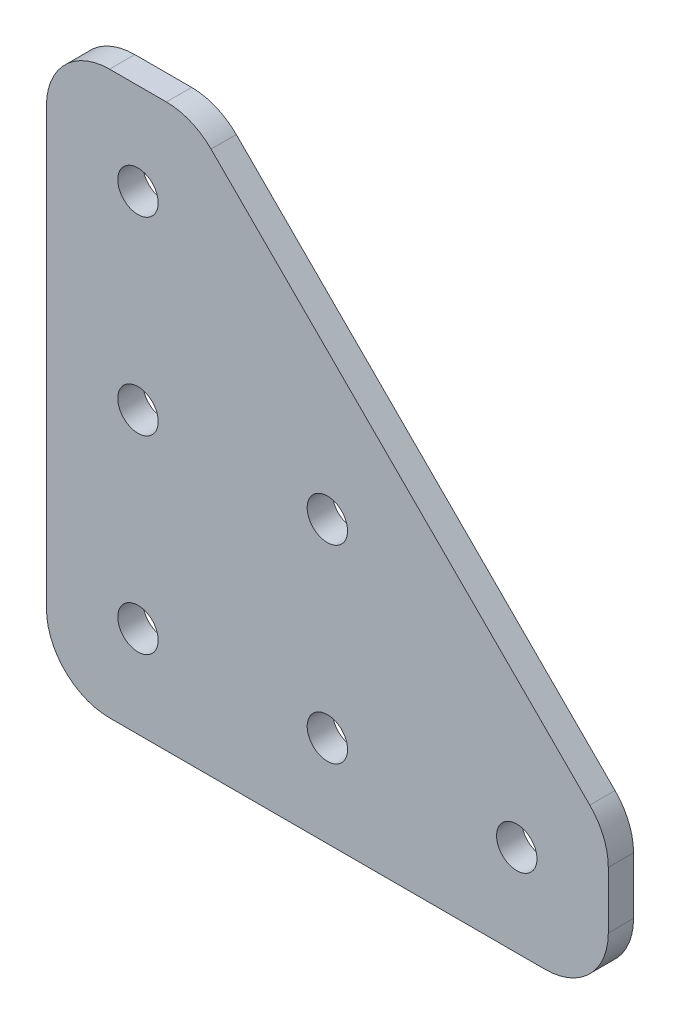
ISO-10303-21;
HEADER;
FILE_DESCRIPTION(('STEP AP214'),'2;1');
FILE_NAME('part.step','',(''),(''),'','','');
FILE_SCHEMA(('AUTOMOTIVE_DESIGN { 1 0 10303 214 1 1 1 1 }'));
ENDSEC;
DATA;
#1=APPLICATION_CONTEXT('core data for automotive mechanical design processes');
#2=APPLICATION_PROTOCOL_DEFINITION('international standard','automotive_design',2000,#1);
#3=PRODUCT_CONTEXT('',#1,'mechanical');
#4=PRODUCT('Part','Part','',(#3));
#5=PRODUCT_RELATED_PRODUCT_CATEGORY('part','',(#4));
#6=PRODUCT_DEFINITION_FORMATION('','',#4);
#7=PRODUCT_DEFINITION_CONTEXT('part definition',#1,'design');
#8=PRODUCT_DEFINITION('design','',#6,#7);
#9=PRODUCT_DEFINITION_SHAPE('','',#8);
#10=(LENGTH_UNIT() NAMED_UNIT(*) SI_UNIT(.MILLI.,.METRE.));
#11=(NAMED_UNIT(*) PLANE_ANGLE_UNIT() SI_UNIT($,.RADIAN.));
#12=(NAMED_UNIT(*) SI_UNIT($,.STERADIAN.) SOLID_ANGLE_UNIT());
#13=UNCERTAINTY_MEASURE_WITH_UNIT(LENGTH_MEASURE(1.E-05),#10,'distance_accuracy_value','');
#14=(GEOMETRIC_REPRESENTATION_CONTEXT(3) GLOBAL_UNCERTAINTY_ASSIGNED_CONTEXT((#13)) GLOBAL_UNIT_ASSIGNED_CONTEXT((#10,
#11,#12)) REPRESENTATION_CONTEXT('',''));
#15=CARTESIAN_POINT('',(0.,0.,0.));
#16=DIRECTION('',(0.,0.,1.));
#17=DIRECTION('',(1.,0.,0.));
#18=AXIS2_PLACEMENT_3D('',#15,#16,#17);
#19=CARTESIAN_POINT('',(5.,39.5,2.));
#20=DIRECTION('',(0.,0.,-1.));
#21=DIRECTION('',(-1.,0.,0.));
#22=AXIS2_PLACEMENT_3D('',#19,#20,#21);
#23=PLANE('',#22);
#24=CARTESIAN_POINT('',(37.25,7.25,2.));
#25=DIRECTION('',(0.,0.,1.));
#26=DIRECTION('',(1.,0.,0.));
#27=AXIS2_PLACEMENT_3D('',#24,#25,#26);
#28=CIRCLE('',#27,1.6);
#29=CARTESIAN_POINT('',(38.85,7.25,2.));
#30=VERTEX_POINT('',#29);
#31=EDGE_CURVE('E229',#30,#30,#28,.T.);
#32=ORIENTED_EDGE('',*,*,#31,.F.);
#33=EDGE_LOOP('',(#32));
#34=FACE_BOUND('',#33,.T.);
#35=CARTESIAN_POINT('',(7.25,37.25,2.));
#36=DIRECTION('',(0.,0.,1.));
#37=DIRECTION('',(1.,0.,0.));
#38=AXIS2_PLACEMENT_3D('',#35,#36,#37);
#39=CIRCLE('',#38,1.6);
#40=CARTESIAN_POINT('',(8.85,37.25,2.));
#41=VERTEX_POINT('',#40);
#42=EDGE_CURVE('E217',#41,#41,#39,.T.);
#43=ORIENTED_EDGE('',*,*,#42,.F.);
#44=EDGE_LOOP('',(#43));
#45=FACE_BOUND('',#44,.T.);
#46=CARTESIAN_POINT('',(7.25,7.25,2.));
#47=DIRECTION('',(0.,0.,1.));
#48=DIRECTION('',(1.,0.,0.));
#49=AXIS2_PLACEMENT_3D('',#46,#47,#48);
#50=CIRCLE('',#49,1.6);
#51=CARTESIAN_POINT('',(8.85,7.25,2.));
#52=VERTEX_POINT('',#51);
#53=EDGE_CURVE('E145',#52,#52,#50,.T.);
#54=ORIENTED_EDGE('',*,*,#53,.F.);
#55=EDGE_LOOP('',(#54));
#56=FACE_BOUND('',#55,.T.);
#57=CARTESIAN_POINT('',(5.,39.5,2.));
#58=DIRECTION('',(0.,0.,1.));
#59=DIRECTION('',(-1.,0.,0.));
#60=AXIS2_PLACEMENT_3D('',#57,#58,#59);
#61=CIRCLE('',#60,5.);
#62=CARTESIAN_POINT('',(5.,44.5,2.));
#63=VERTEX_POINT('',#62);
#64=CARTESIAN_POINT('',(0.,39.5,2.));
#65=VERTEX_POINT('',#64);
#66=EDGE_CURVE('E160',#63,#65,#61,.T.);
#67=ORIENTED_EDGE('',*,*,#66,.T.);
#68=DIRECTION('',(0.,-1.,0.));
#69=VECTOR('',#68,1.);
#70=CARTESIAN_POINT('',(0.,5.00000000000004,2.));
#71=LINE('',#70,#69);
#72=CARTESIAN_POINT('',(0.,5.00000000000004,2.));
#73=VERTEX_POINT('',#72);
#74=EDGE_CURVE('E98',#65,#73,#71,.T.);
#75=ORIENTED_EDGE('',*,*,#74,.T.);
#76=CARTESIAN_POINT('',(5.,5.,2.));
#77=DIRECTION('',(0.,0.,1.));
#78=DIRECTION('',(1.,0.,0.));
#79=AXIS2_PLACEMENT_3D('',#76,#77,#78);
#80=CIRCLE('',#79,5.);
#81=CARTESIAN_POINT('',(5.00000000000003,0.,2.));
#82=VERTEX_POINT('',#81);
#83=EDGE_CURVE('E181',#73,#82,#80,.T.);
#84=ORIENTED_EDGE('',*,*,#83,.T.);
#85=DIRECTION('',(1.,0.,0.));
#86=VECTOR('',#85,1.);
#87=CARTESIAN_POINT('',(5.00000000000004,0.,2.));
#88=LINE('',#87,#86);
#89=CARTESIAN_POINT('',(39.5,0.,2.));
#90=VERTEX_POINT('',#89);
#91=EDGE_CURVE('E200',#82,#90,#88,.T.);
#92=ORIENTED_EDGE('',*,*,#91,.T.);
#93=CARTESIAN_POINT('',(39.5,5.,2.));
#94=DIRECTION('',(0.,0.,1.));
#95=DIRECTION('',(1.,0.,0.));
#96=AXIS2_PLACEMENT_3D('',#93,#94,#95);
#97=CIRCLE('',#96,5.);
#98=CARTESIAN_POINT('',(44.5,5.,2.));
#99=VERTEX_POINT('',#98);
#100=EDGE_CURVE('E197',#90,#99,#97,.T.);
#101=ORIENTED_EDGE('',*,*,#100,.T.);
#102=DIRECTION('',(0.,1.,0.));
#103=VECTOR('',#102,1.);
#104=CARTESIAN_POINT('',(44.5,5.,2.));
#105=LINE('',#104,#103);
#106=CARTESIAN_POINT('',(44.5,9.5,2.));
#107=VERTEX_POINT('',#106);
#108=EDGE_CURVE('E199',#99,#107,#105,.T.);
#109=ORIENTED_EDGE('',*,*,#108,.T.);
#110=CARTESIAN_POINT('',(39.5,9.5,2.));
#111=DIRECTION('',(0.,0.,1.));
#112=DIRECTION('',(-1.,0.,0.));
#113=AXIS2_PLACEMENT_3D('',#110,#111,#112);
#114=CIRCLE('',#113,5.);
#115=CARTESIAN_POINT('',(43.0355339059327,13.0355339059327,2.));
#116=VERTEX_POINT('',#115);
#117=EDGE_CURVE('E123',#107,#116,#114,.T.);
#118=ORIENTED_EDGE('',*,*,#117,.T.);
#119=DIRECTION('',(-0.707106781186548,0.707106781186547,0.));
#120=VECTOR('',#119,1.);
#121=CARTESIAN_POINT('',(13.0355339059327,43.0355339059327,2.));
#122=LINE('',#121,#120);
#123=CARTESIAN_POINT('',(13.0355339059327,43.0355339059327,2.));
#124=VERTEX_POINT('',#123);
#125=EDGE_CURVE('E117',#116,#124,#122,.T.);
#126=ORIENTED_EDGE('',*,*,#125,.T.);
#127=CARTESIAN_POINT('',(9.5,39.5,2.));
#128=DIRECTION('',(0.,0.,1.));
#129=DIRECTION('',(1.,0.,0.));
#130=AXIS2_PLACEMENT_3D('',#127,#128,#129);
#131=CIRCLE('',#130,5.);
#132=CARTESIAN_POINT('',(9.5,44.5,2.));
#133=VERTEX_POINT('',#132);
#134=EDGE_CURVE('E121',#124,#133,#131,.T.);
#135=ORIENTED_EDGE('',*,*,#134,.T.);
#136=DIRECTION('',(-1.,0.,0.));
#137=VECTOR('',#136,1.);
#138=CARTESIAN_POINT('',(5.,44.5,2.));
#139=LINE('',#138,#137);
#140=EDGE_CURVE('E49',#133,#63,#139,.T.);
#141=ORIENTED_EDGE('',*,*,#140,.T.);
#142=EDGE_LOOP('',(#67,#75,#84,#92,#101,#109,#118,#126,#135,#141));
#143=FACE_BOUND('',#142,.T.);
#144=CARTESIAN_POINT('',(7.25,22.25,2.));
#145=DIRECTION('',(0.,0.,1.));
#146=DIRECTION('',(1.,0.,0.));
#147=AXIS2_PLACEMENT_3D('',#144,#145,#146);
#148=CIRCLE('',#147,1.6);
#149=CARTESIAN_POINT('',(8.85,22.25,2.));
#150=VERTEX_POINT('',#149);
#151=EDGE_CURVE('E211',#150,#150,#148,.T.);
#152=ORIENTED_EDGE('',*,*,#151,.F.);
#153=EDGE_LOOP('',(#152));
#154=FACE_BOUND('',#153,.T.);
#155=CARTESIAN_POINT('',(22.25,7.25,2.));
#156=DIRECTION('',(0.,0.,1.));
#157=DIRECTION('',(1.,0.,0.));
#158=AXIS2_PLACEMENT_3D('',#155,#156,#157);
#159=CIRCLE('',#158,1.6);
#160=CARTESIAN_POINT('',(23.85,7.25,2.));
#161=VERTEX_POINT('',#160);
#162=EDGE_CURVE('E223',#161,#161,#159,.T.);
#163=ORIENTED_EDGE('',*,*,#162,.F.);
#164=EDGE_LOOP('',(#163));
#165=FACE_BOUND('',#164,.T.);
#166=CARTESIAN_POINT('',(22.25,22.25,2.));
#167=DIRECTION('',(0.,0.,1.));
#168=DIRECTION('',(1.,0.,0.));
#169=AXIS2_PLACEMENT_3D('',#166,#167,#168);
#170=CIRCLE('',#169,1.6);
#171=CARTESIAN_POINT('',(23.85,22.25,2.));
#172=VERTEX_POINT('',#171);
#173=EDGE_CURVE('E235',#172,#172,#170,.T.);
#174=ORIENTED_EDGE('',*,*,#173,.F.);
#175=EDGE_LOOP('',(#174));
#176=FACE_BOUND('',#175,.T.);
#177=ADVANCED_FACE('F32',(#34,#45,#56,#143,#154,#165,#176),#23,.F.);
#178=CARTESIAN_POINT('',(5.,39.5,0.));
#179=DIRECTION('',(0.,0.,-1.));
#180=DIRECTION('',(-1.,0.,0.));
#181=AXIS2_PLACEMENT_3D('',#178,#179,#180);
#182=PLANE('',#181);
#183=CARTESIAN_POINT('',(37.25,7.25,0.));
#184=DIRECTION('',(0.,0.,1.));
#185=DIRECTION('',(1.,0.,0.));
#186=AXIS2_PLACEMENT_3D('',#183,#184,#185);
#187=CIRCLE('',#186,1.6);
#188=CARTESIAN_POINT('',(38.85,7.25,0.));
#189=VERTEX_POINT('',#188);
#190=EDGE_CURVE('E232',#189,#189,#187,.T.);
#191=ORIENTED_EDGE('',*,*,#190,.T.);
#192=EDGE_LOOP('',(#191));
#193=FACE_BOUND('',#192,.T.);
#194=CARTESIAN_POINT('',(7.25,37.25,0.));
#195=DIRECTION('',(0.,0.,1.));
#196=DIRECTION('',(1.,0.,0.));
#197=AXIS2_PLACEMENT_3D('',#194,#195,#196);
#198=CIRCLE('',#197,1.6);
#199=CARTESIAN_POINT('',(8.85,37.25,0.));
#200=VERTEX_POINT('',#199);
#201=EDGE_CURVE('E220',#200,#200,#198,.T.);
#202=ORIENTED_EDGE('',*,*,#201,.T.);
#203=EDGE_LOOP('',(#202));
#204=FACE_BOUND('',#203,.T.);
#205=CARTESIAN_POINT('',(7.25,7.25,0.));
#206=DIRECTION('',(0.,0.,1.));
#207=DIRECTION('',(1.,0.,0.));
#208=AXIS2_PLACEMENT_3D('',#205,#206,#207);
#209=CIRCLE('',#208,1.6);
#210=CARTESIAN_POINT('',(8.85,7.25,0.));
#211=VERTEX_POINT('',#210);
#212=EDGE_CURVE('E208',#211,#211,#209,.T.);
#213=ORIENTED_EDGE('',*,*,#212,.T.);
#214=EDGE_LOOP('',(#213));
#215=FACE_BOUND('',#214,.T.);
#216=CARTESIAN_POINT('',(5.,39.5,0.));
#217=DIRECTION('',(0.,0.,1.));
#218=DIRECTION('',(-1.,0.,0.));
#219=AXIS2_PLACEMENT_3D('',#216,#217,#218);
#220=CIRCLE('',#219,5.);
#221=CARTESIAN_POINT('',(5.,44.5,0.));
#222=VERTEX_POINT('',#221);
#223=CARTESIAN_POINT('',(0.,39.5,0.));
#224=VERTEX_POINT('',#223);
#225=EDGE_CURVE('E141',#222,#224,#220,.T.);
#226=ORIENTED_EDGE('',*,*,#225,.F.);
#227=DIRECTION('',(-1.,0.,0.));
#228=VECTOR('',#227,1.);
#229=CARTESIAN_POINT('',(5.,44.5,0.));
#230=LINE('',#229,#228);
#231=CARTESIAN_POINT('',(9.5,44.5,0.));
#232=VERTEX_POINT('',#231);
#233=EDGE_CURVE('E90',#232,#222,#230,.T.);
#234=ORIENTED_EDGE('',*,*,#233,.F.);
#235=CARTESIAN_POINT('',(9.5,39.5,0.));
#236=DIRECTION('',(0.,0.,1.));
#237=DIRECTION('',(1.,0.,0.));
#238=AXIS2_PLACEMENT_3D('',#235,#236,#237);
#239=CIRCLE('',#238,5.);
#240=CARTESIAN_POINT('',(13.0355339059327,43.0355339059327,0.));
#241=VERTEX_POINT('',#240);
#242=EDGE_CURVE('E84',#241,#232,#239,.T.);
#243=ORIENTED_EDGE('',*,*,#242,.F.);
#244=DIRECTION('',(-0.707106781186548,0.707106781186547,0.));
#245=VECTOR('',#244,1.);
#246=CARTESIAN_POINT('',(13.0355339059327,43.0355339059327,0.));
#247=LINE('',#246,#245);
#248=CARTESIAN_POINT('',(43.0355339059327,13.0355339059327,0.));
#249=VERTEX_POINT('',#248);
#250=EDGE_CURVE('E131',#249,#241,#247,.T.);
#251=ORIENTED_EDGE('',*,*,#250,.F.);
#252=CARTESIAN_POINT('',(39.5,9.5,0.));
#253=DIRECTION('',(0.,0.,1.));
#254=DIRECTION('',(-1.,0.,0.));
#255=AXIS2_PLACEMENT_3D('',#252,#253,#254);
#256=CIRCLE('',#255,5.);
#257=CARTESIAN_POINT('',(44.5,9.5,0.));
#258=VERTEX_POINT('',#257);
#259=EDGE_CURVE('E155',#258,#249,#256,.T.);
#260=ORIENTED_EDGE('',*,*,#259,.F.);
#261=DIRECTION('',(0.,1.,0.));
#262=VECTOR('',#261,1.);
#263=CARTESIAN_POINT('',(44.5,5.,0.));
#264=LINE('',#263,#262);
#265=CARTESIAN_POINT('',(44.5,5.,0.));
#266=VERTEX_POINT('',#265);
#267=EDGE_CURVE('E153',#266,#258,#264,.T.);
#268=ORIENTED_EDGE('',*,*,#267,.F.);
#269=CARTESIAN_POINT('',(39.5,5.,0.));
#270=DIRECTION('',(0.,0.,1.));
#271=DIRECTION('',(1.,0.,0.));
#272=AXIS2_PLACEMENT_3D('',#269,#270,#271);
#273=CIRCLE('',#272,5.);
#274=CARTESIAN_POINT('',(39.5,0.,0.));
#275=VERTEX_POINT('',#274);
#276=EDGE_CURVE('E151',#275,#266,#273,.T.);
#277=ORIENTED_EDGE('',*,*,#276,.F.);
#278=DIRECTION('',(1.,0.,0.));
#279=VECTOR('',#278,1.);
#280=CARTESIAN_POINT('',(5.00000000000004,0.,0.));
#281=LINE('',#280,#279);
#282=CARTESIAN_POINT('',(5.00000000000003,0.,0.));
#283=VERTEX_POINT('',#282);
#284=EDGE_CURVE('E149',#283,#275,#281,.T.);
#285=ORIENTED_EDGE('',*,*,#284,.F.);
#286=CARTESIAN_POINT('',(5.,5.,0.));
#287=DIRECTION('',(0.,0.,1.));
#288=DIRECTION('',(1.,0.,0.));
#289=AXIS2_PLACEMENT_3D('',#286,#287,#288);
#290=CIRCLE('',#289,5.);
#291=CARTESIAN_POINT('',(0.,5.00000000000004,0.));
#292=VERTEX_POINT('',#291);
#293=EDGE_CURVE('E147',#292,#283,#290,.T.);
#294=ORIENTED_EDGE('',*,*,#293,.F.);
#295=DIRECTION('',(0.,-1.,0.));
#296=VECTOR('',#295,1.);
#297=CARTESIAN_POINT('',(0.,5.00000000000004,0.));
#298=LINE('',#297,#296);
#299=EDGE_CURVE('E144',#224,#292,#298,.T.);
#300=ORIENTED_EDGE('',*,*,#299,.F.);
#301=EDGE_LOOP('',(#226,#234,#243,#251,#260,#268,#277,#285,#294,#300));
#302=FACE_BOUND('',#301,.T.);
#303=CARTESIAN_POINT('',(7.25,22.25,0.));
#304=DIRECTION('',(0.,0.,1.));
#305=DIRECTION('',(1.,0.,0.));
#306=AXIS2_PLACEMENT_3D('',#303,#304,#305);
#307=CIRCLE('',#306,1.6);
#308=CARTESIAN_POINT('',(8.85,22.25,0.));
#309=VERTEX_POINT('',#308);
#310=EDGE_CURVE('E214',#309,#309,#307,.T.);
#311=ORIENTED_EDGE('',*,*,#310,.T.);
#312=EDGE_LOOP('',(#311));
#313=FACE_BOUND('',#312,.T.);
#314=CARTESIAN_POINT('',(22.25,7.25,0.));
#315=DIRECTION('',(0.,0.,1.));
#316=DIRECTION('',(1.,0.,0.));
#317=AXIS2_PLACEMENT_3D('',#314,#315,#316);
#318=CIRCLE('',#317,1.6);
#319=CARTESIAN_POINT('',(23.85,7.25,0.));
#320=VERTEX_POINT('',#319);
#321=EDGE_CURVE('E226',#320,#320,#318,.T.);
#322=ORIENTED_EDGE('',*,*,#321,.T.);
#323=EDGE_LOOP('',(#322));
#324=FACE_BOUND('',#323,.T.);
#325=CARTESIAN_POINT('',(22.25,22.25,0.));
#326=DIRECTION('',(0.,0.,1.));
#327=DIRECTION('',(1.,0.,0.));
#328=AXIS2_PLACEMENT_3D('',#325,#326,#327);
#329=CIRCLE('',#328,1.6);
#330=CARTESIAN_POINT('',(23.85,22.25,0.));
#331=VERTEX_POINT('',#330);
#332=EDGE_CURVE('E238',#331,#331,#329,.T.);
#333=ORIENTED_EDGE('',*,*,#332,.T.);
#334=EDGE_LOOP('',(#333));
#335=FACE_BOUND('',#334,.T.);
#336=ADVANCED_FACE('F185',(#193,#204,#215,#302,#313,#324,#335),#182,.T.);
#337=CARTESIAN_POINT('',(5.,39.5,2.));
#338=DIRECTION('',(0.,0.,-1.));
#339=DIRECTION('',(-1.,0.,0.));
#340=AXIS2_PLACEMENT_3D('',#337,#338,#339);
#341=CYLINDRICAL_SURFACE('',#340,5.);
#342=ORIENTED_EDGE('',*,*,#225,.T.);
#343=DIRECTION('',(0.,0.,-1.));
#344=VECTOR('',#343,1.);
#345=CARTESIAN_POINT('',(0.,39.5,2.));
#346=LINE('',#345,#344);
#347=EDGE_CURVE('E11',#65,#224,#346,.T.);
#348=ORIENTED_EDGE('',*,*,#347,.F.);
#349=ORIENTED_EDGE('',*,*,#66,.F.);
#350=DIRECTION('',(0.,0.,-1.));
#351=VECTOR('',#350,1.);
#352=CARTESIAN_POINT('',(5.,44.5,2.));
#353=LINE('',#352,#351);
#354=EDGE_CURVE('E137',#63,#222,#353,.T.);
#355=ORIENTED_EDGE('',*,*,#354,.T.);
#356=EDGE_LOOP('',(#342,#348,#349,#355));
#357=FACE_BOUND('',#356,.T.);
#358=ADVANCED_FACE('F34',(#357),#341,.T.);
#359=CARTESIAN_POINT('',(0.,5.00000000000004,2.));
#360=DIRECTION('',(1.,0.,0.));
#361=DIRECTION('',(0.,0.,-1.));
#362=AXIS2_PLACEMENT_3D('',#359,#360,#361);
#363=PLANE('',#362);
#364=ORIENTED_EDGE('',*,*,#299,.T.);
#365=DIRECTION('',(0.,0.,-1.));
#366=VECTOR('',#365,1.);
#367=CARTESIAN_POINT('',(0.,5.00000000000004,2.));
#368=LINE('',#367,#366);
#369=EDGE_CURVE('E41',#73,#292,#368,.T.);
#370=ORIENTED_EDGE('',*,*,#369,.F.);
#371=ORIENTED_EDGE('',*,*,#74,.F.);
#372=ORIENTED_EDGE('',*,*,#347,.T.);
#373=EDGE_LOOP('',(#364,#370,#371,#372));
#374=FACE_BOUND('',#373,.T.);
#375=ADVANCED_FACE('F281',(#374),#363,.F.);
#376=CARTESIAN_POINT('',(5.,5.,2.));
#377=DIRECTION('',(0.,0.,-1.));
#378=DIRECTION('',(-1.,0.,0.));
#379=AXIS2_PLACEMENT_3D('',#376,#377,#378);
#380=CYLINDRICAL_SURFACE('',#379,5.);
#381=ORIENTED_EDGE('',*,*,#293,.T.);
#382=DIRECTION('',(0.,0.,-1.));
#383=VECTOR('',#382,1.);
#384=CARTESIAN_POINT('',(5.00000000000003,0.,2.));
#385=LINE('',#384,#383);
#386=EDGE_CURVE('E173',#82,#283,#385,.T.);
#387=ORIENTED_EDGE('',*,*,#386,.F.);
#388=ORIENTED_EDGE('',*,*,#83,.F.);
#389=ORIENTED_EDGE('',*,*,#369,.T.);
#390=EDGE_LOOP('',(#381,#387,#388,#389));
#391=FACE_BOUND('',#390,.T.);
#392=ADVANCED_FACE('F179',(#391),#380,.T.);
#393=CARTESIAN_POINT('',(5.00000000000004,0.,2.));
#394=DIRECTION('',(0.,1.,0.));
#395=DIRECTION('',(0.,0.,1.));
#396=AXIS2_PLACEMENT_3D('',#393,#394,#395);
#397=PLANE('',#396);
#398=ORIENTED_EDGE('',*,*,#284,.T.);
#399=DIRECTION('',(0.,0.,-1.));
#400=VECTOR('',#399,1.);
#401=CARTESIAN_POINT('',(39.5,0.,2.));
#402=LINE('',#401,#400);
#403=EDGE_CURVE('E170',#90,#275,#402,.T.);
#404=ORIENTED_EDGE('',*,*,#403,.F.);
#405=ORIENTED_EDGE('',*,*,#91,.F.);
#406=ORIENTED_EDGE('',*,*,#386,.T.);
#407=EDGE_LOOP('',(#398,#404,#405,#406));
#408=FACE_BOUND('',#407,.T.);
#409=ADVANCED_FACE('F191',(#408),#397,.F.);
#410=CARTESIAN_POINT('',(39.5,5.,2.));
#411=DIRECTION('',(0.,0.,-1.));
#412=DIRECTION('',(-1.,0.,0.));
#413=AXIS2_PLACEMENT_3D('',#410,#411,#412);
#414=CYLINDRICAL_SURFACE('',#413,5.);
#415=ORIENTED_EDGE('',*,*,#276,.T.);
#416=DIRECTION('',(0.,0.,-1.));
#417=VECTOR('',#416,1.);
#418=CARTESIAN_POINT('',(44.5,5.,2.));
#419=LINE('',#418,#417);
#420=EDGE_CURVE('E167',#99,#266,#419,.T.);
#421=ORIENTED_EDGE('',*,*,#420,.F.);
#422=ORIENTED_EDGE('',*,*,#100,.F.);
#423=ORIENTED_EDGE('',*,*,#403,.T.);
#424=EDGE_LOOP('',(#415,#421,#422,#423));
#425=FACE_BOUND('',#424,.T.);
#426=ADVANCED_FACE('F195',(#425),#414,.T.);
#427=CARTESIAN_POINT('',(44.5,5.,2.));
#428=DIRECTION('',(-1.,0.,0.));
#429=DIRECTION('',(0.,0.,1.));
#430=AXIS2_PLACEMENT_3D('',#427,#428,#429);
#431=PLANE('',#430);
#432=ORIENTED_EDGE('',*,*,#267,.T.);
#433=DIRECTION('',(0.,0.,-1.));
#434=VECTOR('',#433,1.);
#435=CARTESIAN_POINT('',(44.5,9.5,2.));
#436=LINE('',#435,#434);
#437=EDGE_CURVE('E164',#107,#258,#436,.T.);
#438=ORIENTED_EDGE('',*,*,#437,.F.);
#439=ORIENTED_EDGE('',*,*,#108,.F.);
#440=ORIENTED_EDGE('',*,*,#420,.T.);
#441=EDGE_LOOP('',(#432,#438,#439,#440));
#442=FACE_BOUND('',#441,.T.);
#443=ADVANCED_FACE('F271',(#442),#431,.F.);
#444=CARTESIAN_POINT('',(39.5,9.5,2.));
#445=DIRECTION('',(0.,0.,-1.));
#446=DIRECTION('',(-1.,0.,0.));
#447=AXIS2_PLACEMENT_3D('',#444,#445,#446);
#448=CYLINDRICAL_SURFACE('',#447,5.);
#449=ORIENTED_EDGE('',*,*,#259,.T.);
#450=DIRECTION('',(0.,0.,-1.));
#451=VECTOR('',#450,1.);
#452=CARTESIAN_POINT('',(43.0355339059327,13.0355339059327,2.));
#453=LINE('',#452,#451);
#454=EDGE_CURVE('E132',#116,#249,#453,.T.);
#455=ORIENTED_EDGE('',*,*,#454,.F.);
#456=ORIENTED_EDGE('',*,*,#117,.F.);
#457=ORIENTED_EDGE('',*,*,#437,.T.);
#458=EDGE_LOOP('',(#449,#455,#456,#457));
#459=FACE_BOUND('',#458,.T.);
#460=ADVANCED_FACE('F268',(#459),#448,.T.);
#461=CARTESIAN_POINT('',(13.0355339059327,43.0355339059327,2.));
#462=DIRECTION('',(-0.707106781186547,-0.707106781186548,0.));
#463=DIRECTION('',(0.707106781186548,-0.707106781186547,0.));
#464=AXIS2_PLACEMENT_3D('',#461,#462,#463);
#465=PLANE('',#464);
#466=ORIENTED_EDGE('',*,*,#250,.T.);
#467=DIRECTION('',(0.,0.,-1.));
#468=VECTOR('',#467,1.);
#469=CARTESIAN_POINT('',(13.0355339059327,43.0355339059327,2.));
#470=LINE('',#469,#468);
#471=EDGE_CURVE('E128',#124,#241,#470,.T.);
#472=ORIENTED_EDGE('',*,*,#471,.F.);
#473=ORIENTED_EDGE('',*,*,#125,.F.);
#474=ORIENTED_EDGE('',*,*,#454,.T.);
#475=EDGE_LOOP('',(#466,#472,#473,#474));
#476=FACE_BOUND('',#475,.T.);
#477=ADVANCED_FACE('F129',(#476),#465,.F.);
#478=CARTESIAN_POINT('',(9.5,39.5,2.));
#479=DIRECTION('',(0.,0.,-1.));
#480=DIRECTION('',(-1.,0.,0.));
#481=AXIS2_PLACEMENT_3D('',#478,#479,#480);
#482=CYLINDRICAL_SURFACE('',#481,5.);
#483=ORIENTED_EDGE('',*,*,#242,.T.);
#484=DIRECTION('',(0.,0.,-1.));
#485=VECTOR('',#484,1.);
#486=CARTESIAN_POINT('',(9.5,44.5,2.));
#487=LINE('',#486,#485);
#488=EDGE_CURVE('E133',#133,#232,#487,.T.);
#489=ORIENTED_EDGE('',*,*,#488,.F.);
#490=ORIENTED_EDGE('',*,*,#134,.F.);
#491=ORIENTED_EDGE('',*,*,#471,.T.);
#492=EDGE_LOOP('',(#483,#489,#490,#491));
#493=FACE_BOUND('',#492,.T.);
#494=ADVANCED_FACE('F135',(#493),#482,.T.);
#495=CARTESIAN_POINT('',(5.,44.5,2.));
#496=DIRECTION('',(0.,-1.,0.));
#497=DIRECTION('',(0.,0.,-1.));
#498=AXIS2_PLACEMENT_3D('',#495,#496,#497);
#499=PLANE('',#498);
#500=ORIENTED_EDGE('',*,*,#233,.T.);
#501=ORIENTED_EDGE('',*,*,#354,.F.);
#502=ORIENTED_EDGE('',*,*,#140,.F.);
#503=ORIENTED_EDGE('',*,*,#488,.T.);
#504=EDGE_LOOP('',(#500,#501,#502,#503));
#505=FACE_BOUND('',#504,.T.);
#506=ADVANCED_FACE('F261',(#505),#499,.F.);
#507=CARTESIAN_POINT('',(7.25,7.25,2.));
#508=DIRECTION('',(0.,0.,-1.));
#509=DIRECTION('',(-1.,0.,0.));
#510=AXIS2_PLACEMENT_3D('',#507,#508,#509);
#511=CYLINDRICAL_SURFACE('',#510,1.6);
#512=ORIENTED_EDGE('',*,*,#53,.T.);
#513=EDGE_LOOP('',(#512));
#514=FACE_BOUND('',#513,.T.);
#515=ORIENTED_EDGE('',*,*,#212,.F.);
#516=EDGE_LOOP('',(#515));
#517=FACE_BOUND('',#516,.T.);
#518=ADVANCED_FACE('F258',(#514,#517),#511,.F.);
#519=CARTESIAN_POINT('',(7.25,22.25,2.));
#520=DIRECTION('',(0.,0.,-1.));
#521=DIRECTION('',(-1.,0.,0.));
#522=AXIS2_PLACEMENT_3D('',#519,#520,#521);
#523=CYLINDRICAL_SURFACE('',#522,1.6);
#524=ORIENTED_EDGE('',*,*,#151,.T.);
#525=EDGE_LOOP('',(#524));
#526=FACE_BOUND('',#525,.T.);
#527=ORIENTED_EDGE('',*,*,#310,.F.);
#528=EDGE_LOOP('',(#527));
#529=FACE_BOUND('',#528,.T.);
#530=ADVANCED_FACE('F357',(#526,#529),#523,.F.);
#531=CARTESIAN_POINT('',(7.25,37.25,2.));
#532=DIRECTION('',(0.,0.,-1.));
#533=DIRECTION('',(-1.,0.,0.));
#534=AXIS2_PLACEMENT_3D('',#531,#532,#533);
#535=CYLINDRICAL_SURFACE('',#534,1.6);
#536=ORIENTED_EDGE('',*,*,#42,.T.);
#537=EDGE_LOOP('',(#536));
#538=FACE_BOUND('',#537,.T.);
#539=ORIENTED_EDGE('',*,*,#201,.F.);
#540=EDGE_LOOP('',(#539));
#541=FACE_BOUND('',#540,.T.);
#542=ADVANCED_FACE('F365',(#538,#541),#535,.F.);
#543=CARTESIAN_POINT('',(22.25,7.25,2.));
#544=DIRECTION('',(0.,0.,-1.));
#545=DIRECTION('',(-1.,0.,0.));
#546=AXIS2_PLACEMENT_3D('',#543,#544,#545);
#547=CYLINDRICAL_SURFACE('',#546,1.6);
#548=ORIENTED_EDGE('',*,*,#162,.T.);
#549=EDGE_LOOP('',(#548));
#550=FACE_BOUND('',#549,.T.);
#551=ORIENTED_EDGE('',*,*,#321,.F.);
#552=EDGE_LOOP('',(#551));
#553=FACE_BOUND('',#552,.T.);
#554=ADVANCED_FACE('F373',(#550,#553),#547,.F.);
#555=CARTESIAN_POINT('',(37.25,7.25,2.));
#556=DIRECTION('',(0.,0.,-1.));
#557=DIRECTION('',(-1.,0.,0.));
#558=AXIS2_PLACEMENT_3D('',#555,#556,#557);
#559=CYLINDRICAL_SURFACE('',#558,1.6);
#560=ORIENTED_EDGE('',*,*,#31,.T.);
#561=EDGE_LOOP('',(#560));
#562=FACE_BOUND('',#561,.T.);
#563=ORIENTED_EDGE('',*,*,#190,.F.);
#564=EDGE_LOOP('',(#563));
#565=FACE_BOUND('',#564,.T.);
#566=ADVANCED_FACE('F382',(#562,#565),#559,.F.);
#567=CARTESIAN_POINT('',(22.25,22.25,2.));
#568=DIRECTION('',(0.,0.,-1.));
#569=DIRECTION('',(-1.,0.,0.));
#570=AXIS2_PLACEMENT_3D('',#567,#568,#569);
#571=CYLINDRICAL_SURFACE('',#570,1.6);
#572=ORIENTED_EDGE('',*,*,#173,.T.);
#573=EDGE_LOOP('',(#572));
#574=FACE_BOUND('',#573,.T.);
#575=ORIENTED_EDGE('',*,*,#332,.F.);
#576=EDGE_LOOP('',(#575));
#577=FACE_BOUND('',#576,.T.);
#578=ADVANCED_FACE('F244',(#574,#577),#571,.F.);
#579=CLOSED_SHELL('',(#177,#336,#358,#375,#392,#409,#426,#443,#460,#477,#494,#506,#518,#530,
#542,#554,#566,#578));
#580=MANIFOLD_SOLID_BREP('B2',#579);
#581=ADVANCED_BREP_SHAPE_REPRESENTATION('',(#18,#580),#14);
#582=SHAPE_DEFINITION_REPRESENTATION(#9,#581);
ENDSEC;
END-ISO-10303-21;
